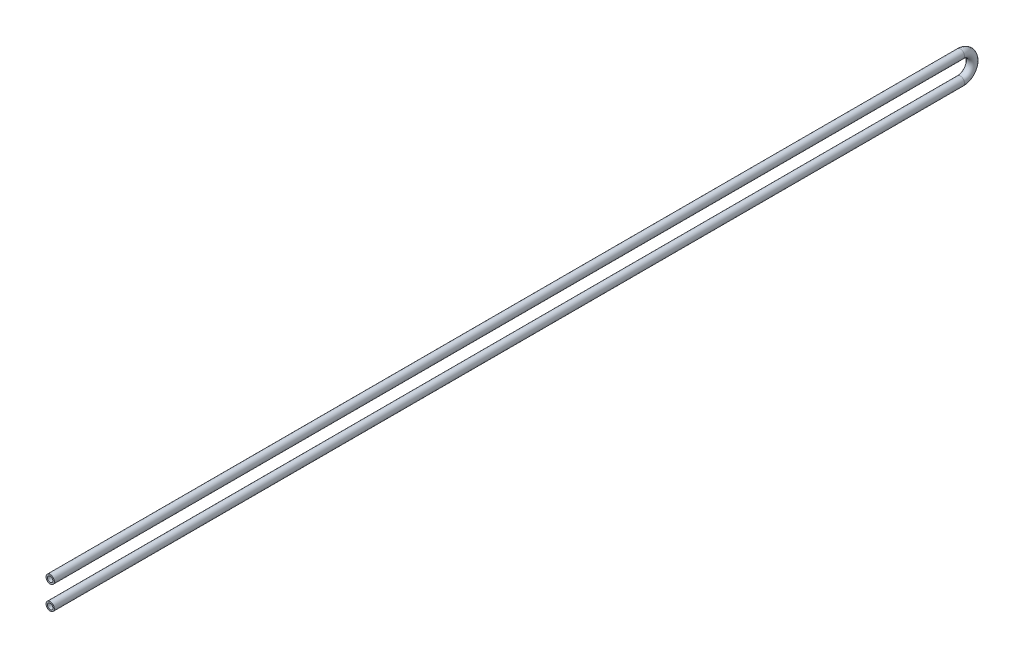
ISO-10303-21;
HEADER;
FILE_DESCRIPTION(('STEP AP214'),'2;1');
FILE_NAME('part.step','',(''),(''),'','','');
FILE_SCHEMA(('AUTOMOTIVE_DESIGN { 1 0 10303 214 1 1 1 1 }'));
ENDSEC;
DATA;
#1=APPLICATION_CONTEXT('core data for automotive mechanical design processes');
#2=APPLICATION_PROTOCOL_DEFINITION('international standard','automotive_design',2000,#1);
#3=PRODUCT_CONTEXT('',#1,'mechanical');
#4=PRODUCT('Part','Part','',(#3));
#5=PRODUCT_RELATED_PRODUCT_CATEGORY('part','',(#4));
#6=PRODUCT_DEFINITION_FORMATION('','',#4);
#7=PRODUCT_DEFINITION_CONTEXT('part definition',#1,'design');
#8=PRODUCT_DEFINITION('design','',#6,#7);
#9=PRODUCT_DEFINITION_SHAPE('','',#8);
#10=(LENGTH_UNIT() NAMED_UNIT(*) SI_UNIT(.MILLI.,.METRE.));
#11=(NAMED_UNIT(*) PLANE_ANGLE_UNIT() SI_UNIT($,.RADIAN.));
#12=(NAMED_UNIT(*) SI_UNIT($,.STERADIAN.) SOLID_ANGLE_UNIT());
#13=UNCERTAINTY_MEASURE_WITH_UNIT(LENGTH_MEASURE(1.E-05),#10,'distance_accuracy_value','');
#14=(GEOMETRIC_REPRESENTATION_CONTEXT(3) GLOBAL_UNCERTAINTY_ASSIGNED_CONTEXT((#13)) GLOBAL_UNIT_ASSIGNED_CONTEXT((#10,
#11,#12)) REPRESENTATION_CONTEXT('',''));
#15=CARTESIAN_POINT('',(0.,0.,0.));
#16=DIRECTION('',(0.,0.,1.));
#17=DIRECTION('',(1.,0.,0.));
#18=AXIS2_PLACEMENT_3D('',#15,#16,#17);
#19=CARTESIAN_POINT('',(0.,30.,0.));
#20=DIRECTION('',(0.,0.,-1.));
#21=DIRECTION('',(-1.,0.,0.));
#22=AXIS2_PLACEMENT_3D('',#19,#20,#21);
#23=CYLINDRICAL_SURFACE('',#22,10.65);
#24=CARTESIAN_POINT('',(0.,30.,-2325.));
#25=DIRECTION('',(0.,0.,1.));
#26=DIRECTION('',(1.,0.,0.));
#27=AXIS2_PLACEMENT_3D('',#24,#25,#26);
#28=CIRCLE('',#27,10.65);
#29=CARTESIAN_POINT('',(0.,40.65,-2325.));
#30=VERTEX_POINT('',#29);
#31=EDGE_CURVE('E55',#30,#30,#28,.T.);
#32=ORIENTED_EDGE('',*,*,#31,.T.);
#33=EDGE_LOOP('',(#32));
#34=FACE_BOUND('',#33,.T.);
#35=CARTESIAN_POINT('',(0.,30.,0.));
#36=DIRECTION('',(0.,0.,1.));
#37=DIRECTION('',(1.,0.,0.));
#38=AXIS2_PLACEMENT_3D('',#35,#36,#37);
#39=CIRCLE('',#38,10.65);
#40=CARTESIAN_POINT('',(10.65,30.,0.));
#41=VERTEX_POINT('',#40);
#42=EDGE_CURVE('E53',#41,#41,#39,.T.);
#43=ORIENTED_EDGE('',*,*,#42,.F.);
#44=EDGE_LOOP('',(#43));
#45=FACE_BOUND('',#44,.T.);
#46=ADVANCED_FACE('F32',(#34,#45),#23,.T.);
#47=CARTESIAN_POINT('',(0.,0.,-2325.));
#48=DIRECTION('',(-1.,0.,0.));
#49=DIRECTION('',(0.,0.,1.));
#50=AXIS2_PLACEMENT_3D('',#47,#48,#49);
#51=TOROIDAL_SURFACE('',#50,30.,10.65);
#52=CARTESIAN_POINT('',(0.,-30.,-2325.));
#53=DIRECTION('',(0.,0.,-1.));
#54=DIRECTION('',(1.,0.,0.));
#55=AXIS2_PLACEMENT_3D('',#52,#53,#54);
#56=CIRCLE('',#55,10.65);
#57=CARTESIAN_POINT('',(0.,-40.65,-2325.));
#58=VERTEX_POINT('',#57);
#59=EDGE_CURVE('E36',#58,#58,#56,.T.);
#60=CARTESIAN_POINT('',(0.,0.,-2325.));
#61=DIRECTION('',(-1.,0.,0.));
#62=DIRECTION('',(0.,0.,1.));
#63=AXIS2_PLACEMENT_3D('',#60,#61,#62);
#64=CIRCLE('',#63,40.65);
#65=EDGE_CURVE('',#30,#58,#64,.T.);
#66=ORIENTED_EDGE('',*,*,#31,.F.);
#67=ORIENTED_EDGE('',*,*,#59,.T.);
#68=ORIENTED_EDGE('',*,*,#65,.T.);
#69=ORIENTED_EDGE('',*,*,#65,.F.);
#70=EDGE_LOOP('',(#66,#68,#67,#69));
#71=FACE_BOUND('',#70,.T.);
#72=ADVANCED_FACE('F62',(#71),#51,.T.);
#73=CARTESIAN_POINT('',(0.,-30.,-2325.));
#74=DIRECTION('',(0.,0.,1.));
#75=DIRECTION('',(1.,0.,0.));
#76=AXIS2_PLACEMENT_3D('',#73,#74,#75);
#77=CYLINDRICAL_SURFACE('',#76,10.65);
#78=CARTESIAN_POINT('',(0.,-30.,0.));
#79=DIRECTION('',(0.,0.,-1.));
#80=DIRECTION('',(1.,0.,0.));
#81=AXIS2_PLACEMENT_3D('',#78,#79,#80);
#82=CIRCLE('',#81,10.65);
#83=CARTESIAN_POINT('',(10.65,-30.,0.));
#84=VERTEX_POINT('',#83);
#85=EDGE_CURVE('E49',#84,#84,#82,.T.);
#86=ORIENTED_EDGE('',*,*,#85,.T.);
#87=EDGE_LOOP('',(#86));
#88=FACE_BOUND('',#87,.T.);
#89=ORIENTED_EDGE('',*,*,#59,.F.);
#90=EDGE_LOOP('',(#89));
#91=FACE_BOUND('',#90,.T.);
#92=ADVANCED_FACE('F34',(#88,#91),#77,.T.);
#93=CARTESIAN_POINT('',(0.,30.,0.));
#94=DIRECTION('',(0.,0.,1.));
#95=DIRECTION('',(1.,0.,0.));
#96=AXIS2_PLACEMENT_3D('',#93,#94,#95);
#97=PLANE('',#96);
#98=CARTESIAN_POINT('',(0.,30.,0.));
#99=DIRECTION('',(0.,0.,1.));
#100=DIRECTION('',(1.,0.,0.));
#101=AXIS2_PLACEMENT_3D('',#98,#99,#100);
#102=CIRCLE('',#101,6.92);
#103=CARTESIAN_POINT('',(6.92,30.,0.));
#104=VERTEX_POINT('',#103);
#105=EDGE_CURVE('E52',#104,#104,#102,.F.);
#106=ORIENTED_EDGE('',*,*,#105,.T.);
#107=EDGE_LOOP('',(#106));
#108=FACE_BOUND('',#107,.T.);
#109=ORIENTED_EDGE('',*,*,#42,.T.);
#110=EDGE_LOOP('',(#109));
#111=FACE_BOUND('',#110,.T.);
#112=ADVANCED_FACE('F66',(#108,#111),#97,.T.);
#113=CARTESIAN_POINT('',(0.,-30.,0.));
#114=DIRECTION('',(0.,0.,-1.));
#115=DIRECTION('',(1.,0.,0.));
#116=AXIS2_PLACEMENT_3D('',#113,#114,#115);
#117=PLANE('',#116);
#118=CARTESIAN_POINT('',(0.,-30.,0.));
#119=DIRECTION('',(0.,0.,-1.));
#120=DIRECTION('',(1.,0.,0.));
#121=AXIS2_PLACEMENT_3D('',#118,#119,#120);
#122=CIRCLE('',#121,6.92);
#123=CARTESIAN_POINT('',(6.92,-30.,0.));
#124=VERTEX_POINT('',#123);
#125=EDGE_CURVE('E10',#124,#124,#122,.F.);
#126=ORIENTED_EDGE('',*,*,#125,.F.);
#127=EDGE_LOOP('',(#126));
#128=FACE_BOUND('',#127,.T.);
#129=ORIENTED_EDGE('',*,*,#85,.F.);
#130=EDGE_LOOP('',(#129));
#131=FACE_BOUND('',#130,.T.);
#132=ADVANCED_FACE('F72',(#128,#131),#117,.F.);
#133=CARTESIAN_POINT('',(0.,30.,0.));
#134=DIRECTION('',(0.,0.,-1.));
#135=DIRECTION('',(-1.,0.,0.));
#136=AXIS2_PLACEMENT_3D('',#133,#134,#135);
#137=CYLINDRICAL_SURFACE('',#136,6.92);
#138=CARTESIAN_POINT('',(0.,30.,-2325.));
#139=DIRECTION('',(0.,0.,1.));
#140=DIRECTION('',(1.,0.,0.));
#141=AXIS2_PLACEMENT_3D('',#138,#139,#140);
#142=CIRCLE('',#141,6.92);
#143=CARTESIAN_POINT('',(0.,36.92,-2325.));
#144=VERTEX_POINT('',#143);
#145=EDGE_CURVE('E45',#144,#144,#142,.F.);
#146=ORIENTED_EDGE('',*,*,#145,.T.);
#147=EDGE_LOOP('',(#146));
#148=FACE_BOUND('',#147,.T.);
#149=ORIENTED_EDGE('',*,*,#105,.F.);
#150=EDGE_LOOP('',(#149));
#151=FACE_BOUND('',#150,.T.);
#152=ADVANCED_FACE('F82',(#148,#151),#137,.F.);
#153=CARTESIAN_POINT('',(0.,0.,-2325.));
#154=DIRECTION('',(-1.,0.,0.));
#155=DIRECTION('',(0.,0.,1.));
#156=AXIS2_PLACEMENT_3D('',#153,#154,#155);
#157=TOROIDAL_SURFACE('',#156,30.,6.92);
#158=CARTESIAN_POINT('',(0.,-30.,-2325.));
#159=DIRECTION('',(0.,0.,-1.));
#160=DIRECTION('',(1.,0.,0.));
#161=AXIS2_PLACEMENT_3D('',#158,#159,#160);
#162=CIRCLE('',#161,6.92);
#163=CARTESIAN_POINT('',(0.,-36.92,-2325.));
#164=VERTEX_POINT('',#163);
#165=EDGE_CURVE('E40',#164,#164,#162,.F.);
#166=CARTESIAN_POINT('',(0.,0.,-2325.));
#167=DIRECTION('',(-1.,0.,0.));
#168=DIRECTION('',(0.,0.,1.));
#169=AXIS2_PLACEMENT_3D('',#166,#167,#168);
#170=CIRCLE('',#169,36.92);
#171=EDGE_CURVE('',#144,#164,#170,.T.);
#172=ORIENTED_EDGE('',*,*,#145,.F.);
#173=ORIENTED_EDGE('',*,*,#165,.T.);
#174=ORIENTED_EDGE('',*,*,#171,.T.);
#175=ORIENTED_EDGE('',*,*,#171,.F.);
#176=EDGE_LOOP('',(#172,#174,#173,#175));
#177=FACE_BOUND('',#176,.T.);
#178=ADVANCED_FACE('F77',(#177),#157,.F.);
#179=CARTESIAN_POINT('',(0.,-30.,-2325.));
#180=DIRECTION('',(0.,0.,1.));
#181=DIRECTION('',(1.,0.,0.));
#182=AXIS2_PLACEMENT_3D('',#179,#180,#181);
#183=CYLINDRICAL_SURFACE('',#182,6.92);
#184=ORIENTED_EDGE('',*,*,#125,.T.);
#185=EDGE_LOOP('',(#184));
#186=FACE_BOUND('',#185,.T.);
#187=ORIENTED_EDGE('',*,*,#165,.F.);
#188=EDGE_LOOP('',(#187));
#189=FACE_BOUND('',#188,.T.);
#190=ADVANCED_FACE('F75',(#186,#189),#183,.F.);
#191=CLOSED_SHELL('',(#46,#72,#92,#112,#132,#152,#178,#190));
#192=MANIFOLD_SOLID_BREP('B2',#191);
#193=ADVANCED_BREP_SHAPE_REPRESENTATION('',(#18,#192),#14);
#194=SHAPE_DEFINITION_REPRESENTATION(#9,#193);
ENDSEC;
END-ISO-10303-21;
